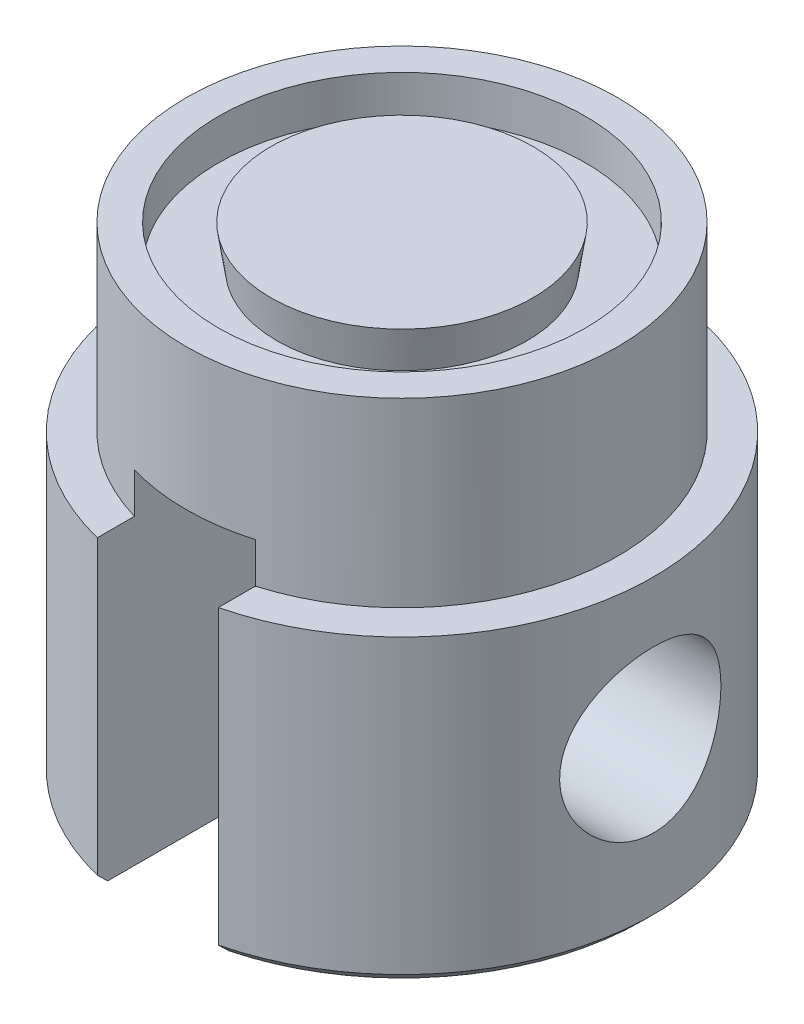
ISO-10303-21;
HEADER;
FILE_DESCRIPTION(('STEP AP214'),'2;1');
FILE_NAME('part.step','',(''),(''),'','','');
FILE_SCHEMA(('AUTOMOTIVE_DESIGN { 1 0 10303 214 1 1 1 1 }'));
ENDSEC;
DATA;
#1=APPLICATION_CONTEXT('core data for automotive mechanical design processes');
#2=APPLICATION_PROTOCOL_DEFINITION('international standard','automotive_design',2000,#1);
#3=PRODUCT_CONTEXT('',#1,'mechanical');
#4=PRODUCT('Part','Part','',(#3));
#5=PRODUCT_RELATED_PRODUCT_CATEGORY('part','',(#4));
#6=PRODUCT_DEFINITION_FORMATION('','',#4);
#7=PRODUCT_DEFINITION_CONTEXT('part definition',#1,'design');
#8=PRODUCT_DEFINITION('design','',#6,#7);
#9=PRODUCT_DEFINITION_SHAPE('','',#8);
#10=(LENGTH_UNIT() NAMED_UNIT(*) SI_UNIT(.MILLI.,.METRE.));
#11=(NAMED_UNIT(*) PLANE_ANGLE_UNIT() SI_UNIT($,.RADIAN.));
#12=(NAMED_UNIT(*) SI_UNIT($,.STERADIAN.) SOLID_ANGLE_UNIT());
#13=UNCERTAINTY_MEASURE_WITH_UNIT(LENGTH_MEASURE(1.E-05),#10,'distance_accuracy_value','');
#14=(GEOMETRIC_REPRESENTATION_CONTEXT(3) GLOBAL_UNCERTAINTY_ASSIGNED_CONTEXT((#13)) GLOBAL_UNIT_ASSIGNED_CONTEXT((#10,
#11,#12)) REPRESENTATION_CONTEXT('',''));
#15=CARTESIAN_POINT('',(0.,0.,0.));
#16=DIRECTION('',(0.,0.,1.));
#17=DIRECTION('',(1.,0.,0.));
#18=AXIS2_PLACEMENT_3D('',#15,#16,#17);
#19=CARTESIAN_POINT('',(-12.475,-9.,0.));
#20=DIRECTION('',(0.,1.,0.));
#21=DIRECTION('',(0.,0.,1.));
#22=AXIS2_PLACEMENT_3D('',#19,#20,#21);
#23=PLANE('',#22);
#24=DIRECTION('',(0.,0.,1.));
#25=VECTOR('',#24,1.);
#26=CARTESIAN_POINT('',(-3.,-9.,0.));
#27=LINE('',#26,#25);
#28=CARTESIAN_POINT('',(-3.,-9.,-12.1089068457892));
#29=VERTEX_POINT('',#28);
#30=CARTESIAN_POINT('',(-3.,-9.,-10.2708324881676));
#31=VERTEX_POINT('',#30);
#32=EDGE_CURVE('E138',#29,#31,#27,.T.);
#33=ORIENTED_EDGE('',*,*,#32,.F.);
#34=CARTESIAN_POINT('',(0.,-9.,0.));
#35=DIRECTION('',(0.,1.,0.));
#36=DIRECTION('',(0.,0.,1.));
#37=AXIS2_PLACEMENT_3D('',#34,#35,#36);
#38=CIRCLE('',#37,12.475);
#39=CARTESIAN_POINT('',(-3.,-9.,12.1089068457892));
#40=VERTEX_POINT('',#39);
#41=EDGE_CURVE('E169',#29,#40,#38,.T.);
#42=ORIENTED_EDGE('',*,*,#41,.T.);
#43=CARTESIAN_POINT('',(-3.,-9.,10.2708324881676));
#44=VERTEX_POINT('',#43);
#45=EDGE_CURVE('E148',#44,#40,#27,.T.);
#46=ORIENTED_EDGE('',*,*,#45,.F.);
#47=CARTESIAN_POINT('',(0.,-9.,0.));
#48=DIRECTION('',(0.,1.,0.));
#49=DIRECTION('',(0.,0.,1.));
#50=AXIS2_PLACEMENT_3D('',#47,#48,#49);
#51=CIRCLE('',#50,10.7);
#52=EDGE_CURVE('E175',#31,#44,#51,.T.);
#53=ORIENTED_EDGE('',*,*,#52,.F.);
#54=EDGE_LOOP('',(#33,#42,#46,#53));
#55=FACE_BOUND('',#54,.T.);
#56=ADVANCED_FACE('F32',(#55),#23,.T.);
#57=CARTESIAN_POINT('',(0.,0.,0.));
#58=DIRECTION('',(0.,1.,0.));
#59=DIRECTION('',(0.,0.,1.));
#60=AXIS2_PLACEMENT_3D('',#57,#58,#59);
#61=CYLINDRICAL_SURFACE('',#60,12.475);
#62=CARTESIAN_POINT('',(-12.475,-12.,0.));
#63=CARTESIAN_POINT('',(-12.4749995139987,-12.0000005360059,-0.218716529110247));
#64=CARTESIAN_POINT('',(-12.4691942485326,-12.0179976823893,-0.437439975480717));
#65=CARTESIAN_POINT('',(-12.4466058032758,-12.0893099880015,-0.868472654449911));
#66=CARTESIAN_POINT('',(-12.4298206606789,-12.1426314619684,-1.08078073311153));
#67=CARTESIAN_POINT('',(-12.387102365798,-12.2825966867381,-1.49270551610944));
#68=CARTESIAN_POINT('',(-12.3611838174692,-12.3691872614064,-1.69234188413075));
#69=CARTESIAN_POINT('',(-12.3028630176797,-12.5730010186972,-2.07426052854814));
#70=CARTESIAN_POINT('',(-12.2704596427904,-12.6902295100976,-2.25653978992013));
#71=CARTESIAN_POINT('',(-12.2014256062733,-12.955977968345,-2.60446423109299));
#72=CARTESIAN_POINT('',(-12.1646992743743,-13.1053102476501,-2.76946988845796));
#73=CARTESIAN_POINT('',(-12.0917019240696,-13.429298724749,-3.07257606487168));
#74=CARTESIAN_POINT('',(-12.0554309975307,-13.6039599456027,-3.21067123445773));
#75=CARTESIAN_POINT('',(-11.9864147056354,-13.9792692831997,-3.45957380721923));
#76=CARTESIAN_POINT('',(-11.9537868569233,-14.1804791344763,-3.56956989199369));
#77=CARTESIAN_POINT('',(-11.8971959388877,-14.5997568517174,-3.75389375003612));
#78=CARTESIAN_POINT('',(-11.8732304499738,-14.8178199894935,-3.82823148537808));
#79=CARTESIAN_POINT('',(-11.8376809760826,-15.2573755385477,-3.93676565428442));
#80=CARTESIAN_POINT('',(-11.8257306485731,-15.4785433888699,-3.97215311941641));
#81=CARTESIAN_POINT('',(-11.8144784036424,-15.9239751756848,-4.00550417775951));
#82=CARTESIAN_POINT('',(-11.8151729179765,-16.1482382208961,-4.00347832862167));
#83=CARTESIAN_POINT('',(-11.828809406831,-16.5835268152945,-3.9629891910265));
#84=CARTESIAN_POINT('',(-11.8412373453728,-16.7947134558122,-3.92605514103782));
#85=CARTESIAN_POINT('',(-11.8761029796758,-17.2077180920951,-3.81928332146221));
#86=CARTESIAN_POINT('',(-11.8985417905715,-17.4095350413824,-3.74944188619597));
#87=CARTESIAN_POINT('',(-11.9512841093102,-17.8016494474232,-3.57778849035795));
#88=CARTESIAN_POINT('',(-11.981701953461,-17.991725236198,-3.47550680880753));
#89=CARTESIAN_POINT('',(-12.0469243552602,-18.352510290474,-3.24220245127108));
#90=CARTESIAN_POINT('',(-12.0817301012408,-18.5232142858167,-3.11117198239018));
#91=CARTESIAN_POINT('',(-12.1538534939489,-18.8490358226826,-2.81664665851643));
#92=CARTESIAN_POINT('',(-12.1912114597255,-19.0030096152706,-2.65189397976041));
#93=CARTESIAN_POINT('',(-12.262758937203,-19.2814289578531,-2.29844255636494));
#94=CARTESIAN_POINT('',(-12.296948188608,-19.4058720833422,-2.10974184751244));
#95=CARTESIAN_POINT('',(-12.358698304347,-19.6225278320352,-1.71146189044504));
#96=CARTESIAN_POINT('',(-12.3861997853495,-19.7144547808581,-1.50171740834568));
#97=CARTESIAN_POINT('',(-12.4310462265841,-19.8613751787336,-1.06865230222356));
#98=CARTESIAN_POINT('',(-12.4483944403095,-19.916380459725,-0.845336052458977));
#99=CARTESIAN_POINT('',(-12.4704501985938,-19.985917960839,-0.401165060374678));
#100=CARTESIAN_POINT('',(-12.4756407047232,-20.0019974180946,-0.180576184698425));
#101=CARTESIAN_POINT('',(-12.4742323099182,-19.9976065373865,0.260178700328372));
#102=CARTESIAN_POINT('',(-12.4676352326971,-19.9771418533412,0.480344769817667));
#103=CARTESIAN_POINT('',(-12.4437109136667,-19.9014791805184,0.907950254804144));
#104=CARTESIAN_POINT('',(-12.4266717213786,-19.8472129806761,1.115572224401));
#105=CARTESIAN_POINT('',(-12.3838729162273,-19.7066353898048,1.51869708609424));
#106=CARTESIAN_POINT('',(-12.3581122107684,-19.6203199836502,1.71419845613877));
#107=CARTESIAN_POINT('',(-12.2997001304643,-19.4156741992699,2.0930071853402));
#108=CARTESIAN_POINT('',(-12.2668917149897,-19.2965930701891,2.27588407018708));
#109=CARTESIAN_POINT('',(-12.1981242103405,-19.030689459409,2.61957257914628));
#110=CARTESIAN_POINT('',(-12.162164225962,-18.883859081743,2.78037790032296));
#111=CARTESIAN_POINT('',(-12.0892469443718,-18.5593460331726,3.08235179747594));
#112=CARTESIAN_POINT('',(-12.0523108969037,-18.3806292990131,3.22241683631407));
#113=CARTESIAN_POINT('',(-11.9831822045273,-18.0014282798997,3.47068195088737));
#114=CARTESIAN_POINT('',(-11.9509895238994,-17.8009441588838,3.5788822665843));
#115=CARTESIAN_POINT('',(-11.8953360615663,-17.3841374550545,3.75973175782995));
#116=CARTESIAN_POINT('',(-11.8718470977001,-17.1678687536019,3.83249591857605));
#117=CARTESIAN_POINT('',(-11.8365129105098,-16.7252330313213,3.94028773137452));
#118=CARTESIAN_POINT('',(-11.8246629505738,-16.4988701576601,3.97533073499576));
#119=CARTESIAN_POINT('',(-11.8144596013936,-16.0540576344009,4.00554560484048));
#120=CARTESIAN_POINT('',(-11.8154906680489,-15.8357441513263,4.00253580967695));
#121=CARTESIAN_POINT('',(-11.829427631134,-15.4029008891127,3.96115294780775));
#122=CARTESIAN_POINT('',(-11.8423329174407,-15.1883709161459,3.92278169805022));
#123=CARTESIAN_POINT('',(-11.8781230093645,-14.7726248338063,3.81301000219897));
#124=CARTESIAN_POINT('',(-11.9008423382915,-14.5712490834383,3.74215608894064));
#125=CARTESIAN_POINT('',(-11.9536508889283,-14.1830850183708,3.56986503296479));
#126=CARTESIAN_POINT('',(-11.9837416646728,-13.996299790583,3.46842144034568));
#127=CARTESIAN_POINT('',(-12.0494371631587,-13.6343479886769,3.23298407958125));
#128=CARTESIAN_POINT('',(-12.0852170259248,-13.4599686838105,3.09782905670221));
#129=CARTESIAN_POINT('',(-12.1574822001888,-13.1357768998528,2.80081775537237));
#130=CARTESIAN_POINT('',(-12.1939677019925,-12.9859711543439,2.63895418260612));
#131=CARTESIAN_POINT('',(-12.2650668280077,-12.7099116467927,2.28630363160152));
#132=CARTESIAN_POINT('',(-12.2995701164844,-12.5846666796025,2.09470211930446));
#133=CARTESIAN_POINT('',(-12.3613891314269,-12.3683189897842,1.69206286568374));
#134=CARTESIAN_POINT('',(-12.3887073110661,-12.2772046096119,1.48103179140166));
#135=CARTESIAN_POINT('',(-12.4315017960826,-12.1372629176453,1.06061110318652));
#136=CARTESIAN_POINT('',(-12.4476672514307,-12.0859437800199,0.852120194497765));
#137=CARTESIAN_POINT('',(-12.4694153811539,-12.0173159489015,0.429087478703662));
#138=CARTESIAN_POINT('',(-12.4750004767365,-11.9999994742122,0.214547067372944));
#139=CARTESIAN_POINT('',(-12.475,-12.,0.));
#140=B_SPLINE_CURVE_WITH_KNOTS('',3,(#62,#63,#64,#65,#66,#67,#68,#69,#70,#71,#72,#73,#74,#75,
#76,#77,#78,#79,#80,#81,#82,#83,#84,#85,#86,#87,#88,#89,#90,#91,#92,#93,#94,#95,#96,#97,#98,#99,
#100,#101,#102,#103,#104,#105,#106,#107,#108,#109,#110,#111,#112,#113,#114,#115,#116,#117,#118,
#119,#120,#121,#122,#123,#124,#125,#126,#127,#128,#129,#130,#131,#132,#133,#134,#135,#136,#137,
#138,#139),.UNSPECIFIED.,.T.,.F.,(4,2,2,2,2,2,2,2,2,2,2,2,2,2,2,2,2,2,2,2,2,2,2,2,2,2,2,2,2,2,2,
2,2,2,2,2,2,2,4),(0.,0.655360630044577,1.3108384469701,1.96527290118171,2.61982082764279,
3.29344287525122,3.96719869406012,4.65863783939568,5.34988370081177,6.01934864674915,
6.68862467947721,7.32987718545076,7.97120113988384,8.62227118061441,9.27351792454189,
9.95607128249465,10.6386806595733,11.3271463407797,12.0153912904177,12.6757947907185,
13.3360961256959,13.9789550586526,14.6218945561876,15.2810079490902,15.9403091739137,
16.6272041728203,17.3140939988358,17.9987398646902,18.6831069913074,19.3349006495619,
19.9866608191133,20.6278360470582,21.2691465628643,21.936677382078,22.6043908118829,
23.2954931077488,23.9863591370202,24.6293735870827,25.2722408720554),.UNSPECIFIED.);
#141=CARTESIAN_POINT('',(-12.475,-12.,0.));
#142=VERTEX_POINT('',#141);
#143=EDGE_CURVE('E128',#142,#142,#140,.T.);
#144=ORIENTED_EDGE('',*,*,#143,.F.);
#145=EDGE_LOOP('',(#144));
#146=FACE_BOUND('',#145,.T.);
#147=DIRECTION('',(0.,1.,0.));
#148=VECTOR('',#147,1.);
#149=CARTESIAN_POINT('',(-3.,0.,-12.1089068457892));
#150=LINE('',#149,#148);
#151=CARTESIAN_POINT('',(-3.,-23.5,-12.1089068457892));
#152=VERTEX_POINT('',#151);
#153=EDGE_CURVE('E135',#152,#29,#150,.T.);
#154=ORIENTED_EDGE('',*,*,#153,.F.);
#155=CARTESIAN_POINT('',(0.,-23.5,0.));
#156=DIRECTION('',(0.,-1.,0.));
#157=DIRECTION('',(0.,0.,-1.));
#158=AXIS2_PLACEMENT_3D('',#155,#156,#157);
#159=CIRCLE('',#158,12.475);
#160=CARTESIAN_POINT('',(-3.,-23.5,12.1089068457892));
#161=VERTEX_POINT('',#160);
#162=EDGE_CURVE('E229',#152,#161,#159,.F.);
#163=ORIENTED_EDGE('',*,*,#162,.T.);
#164=DIRECTION('',(0.,1.,0.));
#165=VECTOR('',#164,1.);
#166=CARTESIAN_POINT('',(-3.,0.,12.1089068457892));
#167=LINE('',#166,#165);
#168=EDGE_CURVE('E150',#40,#161,#167,.F.);
#169=ORIENTED_EDGE('',*,*,#168,.F.);
#170=ORIENTED_EDGE('',*,*,#41,.F.);
#171=EDGE_LOOP('',(#154,#163,#169,#170));
#172=FACE_BOUND('',#171,.T.);
#173=ADVANCED_FACE('F281',(#146,#172),#61,.T.);
#174=CARTESIAN_POINT('',(-12.475,-24.,0.));
#175=DIRECTION('',(0.,-1.,0.));
#176=DIRECTION('',(0.,0.,-1.));
#177=AXIS2_PLACEMENT_3D('',#174,#175,#176);
#178=PLANE('',#177);
#179=DIRECTION('',(0.,0.,-1.));
#180=VECTOR('',#179,1.);
#181=CARTESIAN_POINT('',(-3.,-24.,0.));
#182=LINE('',#181,#180);
#183=CARTESIAN_POINT('',(-3.,-24.,11.5931283526061));
#184=VERTEX_POINT('',#183);
#185=CARTESIAN_POINT('',(-3.,-24.,-11.5931283526061));
#186=VERTEX_POINT('',#185);
#187=EDGE_CURVE('E178',#184,#186,#182,.T.);
#188=ORIENTED_EDGE('',*,*,#187,.F.);
#189=CARTESIAN_POINT('',(0.,-24.,0.));
#190=DIRECTION('',(0.,-1.,0.));
#191=DIRECTION('',(0.,0.,-1.));
#192=AXIS2_PLACEMENT_3D('',#189,#190,#191);
#193=CIRCLE('',#192,11.975);
#194=EDGE_CURVE('E11',#184,#186,#193,.T.);
#195=ORIENTED_EDGE('',*,*,#194,.T.);
#196=EDGE_LOOP('',(#188,#195));
#197=FACE_BOUND('',#196,.T.);
#198=ADVANCED_FACE('F287',(#197),#178,.T.);
#199=CARTESIAN_POINT('',(0.,0.,0.));
#200=DIRECTION('',(0.,1.,0.));
#201=DIRECTION('',(0.,0.,1.));
#202=AXIS2_PLACEMENT_3D('',#199,#200,#201);
#203=CYLINDRICAL_SURFACE('',#202,10.7);
#204=DIRECTION('',(0.,1.,0.));
#205=VECTOR('',#204,1.);
#206=CARTESIAN_POINT('',(-3.,0.,-10.2708324881676));
#207=LINE('',#206,#205);
#208=CARTESIAN_POINT('',(-3.,-7.,-10.2708324881676));
#209=VERTEX_POINT('',#208);
#210=EDGE_CURVE('E147',#31,#209,#207,.T.);
#211=ORIENTED_EDGE('',*,*,#210,.F.);
#212=ORIENTED_EDGE('',*,*,#52,.T.);
#213=DIRECTION('',(0.,1.,0.));
#214=VECTOR('',#213,1.);
#215=CARTESIAN_POINT('',(-3.,0.,10.2708324881676));
#216=LINE('',#215,#214);
#217=CARTESIAN_POINT('',(-3.,-7.,10.2708324881676));
#218=VERTEX_POINT('',#217);
#219=EDGE_CURVE('E152',#218,#44,#216,.F.);
#220=ORIENTED_EDGE('',*,*,#219,.F.);
#221=CARTESIAN_POINT('',(0.,-7.,0.));
#222=DIRECTION('',(0.,1.,0.));
#223=DIRECTION('',(0.,0.,1.));
#224=AXIS2_PLACEMENT_3D('',#221,#222,#223);
#225=CIRCLE('',#224,10.7);
#226=CARTESIAN_POINT('',(3.,-7.,10.2708324881676));
#227=VERTEX_POINT('',#226);
#228=EDGE_CURVE('E119',#227,#218,#225,.F.);
#229=ORIENTED_EDGE('',*,*,#228,.F.);
#230=DIRECTION('',(0.,1.,0.));
#231=VECTOR('',#230,1.);
#232=CARTESIAN_POINT('',(3.,0.,10.2708324881676));
#233=LINE('',#232,#231);
#234=CARTESIAN_POINT('',(3.,-9.,10.2708324881676));
#235=VERTEX_POINT('',#234);
#236=EDGE_CURVE('E127',#235,#227,#233,.T.);
#237=ORIENTED_EDGE('',*,*,#236,.F.);
#238=CARTESIAN_POINT('',(3.,-9.,-10.2708324881676));
#239=VERTEX_POINT('',#238);
#240=EDGE_CURVE('E134',#235,#239,#51,.T.);
#241=ORIENTED_EDGE('',*,*,#240,.T.);
#242=DIRECTION('',(0.,1.,0.));
#243=VECTOR('',#242,1.);
#244=CARTESIAN_POINT('',(3.,0.,-10.2708324881676));
#245=LINE('',#244,#243);
#246=CARTESIAN_POINT('',(3.,-7.,-10.2708324881676));
#247=VERTEX_POINT('',#246);
#248=EDGE_CURVE('E124',#247,#239,#245,.F.);
#249=ORIENTED_EDGE('',*,*,#248,.F.);
#250=EDGE_CURVE('E108',#209,#247,#225,.F.);
#251=ORIENTED_EDGE('',*,*,#250,.F.);
#252=EDGE_LOOP('',(#211,#212,#220,#229,#237,#241,#249,#251));
#253=FACE_BOUND('',#252,.T.);
#254=CARTESIAN_POINT('',(0.,0.,0.));
#255=DIRECTION('',(0.,1.,0.));
#256=DIRECTION('',(0.,0.,1.));
#257=AXIS2_PLACEMENT_3D('',#254,#255,#256);
#258=CIRCLE('',#257,10.7);
#259=CARTESIAN_POINT('',(0.,0.,10.7));
#260=VERTEX_POINT('',#259);
#261=EDGE_CURVE('E154',#260,#260,#258,.T.);
#262=ORIENTED_EDGE('',*,*,#261,.F.);
#263=EDGE_LOOP('',(#262));
#264=FACE_BOUND('',#263,.T.);
#265=ADVANCED_FACE('F131',(#253,#264),#203,.T.);
#266=DIRECTION('',(0.,0.,-1.));
#267=VECTOR('',#266,1.);
#268=CARTESIAN_POINT('',(3.,-9.,0.));
#269=LINE('',#268,#267);
#270=CARTESIAN_POINT('',(3.,-9.,12.1089068457892));
#271=VERTEX_POINT('',#270);
#272=EDGE_CURVE('E142',#271,#235,#269,.T.);
#273=ORIENTED_EDGE('',*,*,#272,.F.);
#274=CARTESIAN_POINT('',(3.,-9.,-12.1089068457892));
#275=VERTEX_POINT('',#274);
#276=EDGE_CURVE('E172',#271,#275,#38,.T.);
#277=ORIENTED_EDGE('',*,*,#276,.T.);
#278=EDGE_CURVE('E136',#239,#275,#269,.T.);
#279=ORIENTED_EDGE('',*,*,#278,.F.);
#280=ORIENTED_EDGE('',*,*,#240,.F.);
#281=EDGE_LOOP('',(#273,#277,#279,#280));
#282=FACE_BOUND('',#281,.T.);
#283=ADVANCED_FACE('F283',(#282),#23,.T.);
#284=CARTESIAN_POINT('',(11.8163287445805,-16.,-4.));
#285=CARTESIAN_POINT('',(11.8163293716046,-15.781609970276,-3.9999994343158));
#286=CARTESIAN_POINT('',(11.8224494097261,-15.563213018424,-3.98205403855416));
#287=CARTESIAN_POINT('',(11.8461529080135,-15.1328561161005,-3.91096593534317));
#288=CARTESIAN_POINT('',(11.8637389903266,-14.9208976496407,-3.85781517680383));
#289=CARTESIAN_POINT('',(11.9081823519474,-14.5097163925374,-3.71834848933976));
#290=CARTESIAN_POINT('',(11.9350225456114,-14.3104709279899,-3.63209364671756));
#291=CARTESIAN_POINT('',(11.9949257570381,-13.9292198049383,-3.42907298676926));
#292=CARTESIAN_POINT('',(12.0279899818919,-13.7472175008901,-3.31230124927523));
#293=CARTESIAN_POINT('',(12.0979573717117,-13.3990345911543,-3.04703684141803));
#294=CARTESIAN_POINT('',(12.134950916007,-13.2335693065452,-2.89762886344134));
#295=CARTESIAN_POINT('',(12.2078416485258,-12.929560825762,-2.57328972032871));
#296=CARTESIAN_POINT('',(12.2437386744481,-12.7910215989288,-2.39835479874891));
#297=CARTESIAN_POINT('',(12.3114304068411,-12.5416072219937,-2.02275240917753));
#298=CARTESIAN_POINT('',(12.343106345104,-12.4314736630668,-1.82156920734679));
#299=CARTESIAN_POINT('',(12.3977278393928,-12.24688880762,-1.40234516910522));
#300=CARTESIAN_POINT('',(12.4206755618851,-12.1724286552636,-1.1843085321436));
#301=CARTESIAN_POINT('',(12.4546151476856,-12.0637069622264,-0.745060624805799));
#302=CARTESIAN_POINT('',(12.4659701166171,-12.0282217418228,-0.524180810154712));
#303=CARTESIAN_POINT('',(12.4767297133512,-11.9945748134697,-0.0793299306597381));
#304=CARTESIAN_POINT('',(12.4761371968552,-11.9964041865455,0.144640382700019));
#305=CARTESIAN_POINT('',(12.4633188207247,-12.0365405781829,0.580683422524086));
#306=CARTESIAN_POINT('',(12.451516335416,-12.0735200969508,0.792892794508262));
#307=CARTESIAN_POINT('',(12.4181290258081,-12.1807223296242,1.2079169454142));
#308=CARTESIAN_POINT('',(12.3965435529035,-12.2509472476909,1.41073110045658));
#309=CARTESIAN_POINT('',(12.3454585586366,-12.4234695738055,1.80420881218555));
#310=CARTESIAN_POINT('',(12.31586270281,-12.5261601287241,1.99468696864473));
#311=CARTESIAN_POINT('',(12.2518608711338,-12.7603801381026,2.35611277682023));
#312=CARTESIAN_POINT('',(12.2174536316828,-12.891917173614,2.52705527643544));
#313=CARTESIAN_POINT('',(12.1457008814245,-13.1868640170738,2.85246658813641));
#314=CARTESIAN_POINT('',(12.1082926795379,-13.3514166808028,3.00588718523103));
#315=CARTESIAN_POINT('',(12.036042035235,-13.7042533539727,3.2832781963095));
#316=CARTESIAN_POINT('',(12.0011999296185,-13.8925404697934,3.40724474919171));
#317=CARTESIAN_POINT('',(11.9376996145303,-14.290600184222,3.62351565554029));
#318=CARTESIAN_POINT('',(11.9091228620333,-14.5006088645345,3.71541119879147));
#319=CARTESIAN_POINT('',(11.862338877103,-14.9342608650721,3.86219440784835));
#320=CARTESIAN_POINT('',(11.8441276843777,-15.157898941813,3.91709620905183));
#321=CARTESIAN_POINT('',(11.8210223950061,-15.6023754944969,3.98626848007884));
#322=CARTESIAN_POINT('',(11.815600040764,-15.8229356109446,4.00215187071912));
#323=CARTESIAN_POINT('',(11.8172158509013,-16.2635917112,3.99738017985765));
#324=CARTESIAN_POINT('',(11.8242519636016,-16.483687765454,3.9767311145762));
#325=CARTESIAN_POINT('',(11.84946838581,-16.9100750512054,3.90092524500849));
#326=CARTESIAN_POINT('',(11.8672969562793,-17.1165827127413,3.84685650154382));
#327=CARTESIAN_POINT('',(11.911711298621,-17.5175648815649,3.70703431432635));
#328=CARTESIAN_POINT('',(11.9382985476178,-17.7120373525784,3.62127552584684));
#329=CARTESIAN_POINT('',(11.9982195654303,-18.0898611783651,3.41758857334324));
#330=CARTESIAN_POINT('',(12.0317311413693,-18.2727067889399,3.29877597219038));
#331=CARTESIAN_POINT('',(12.1013657583466,-18.6164512162654,3.03337484828727));
#332=CARTESIAN_POINT('',(12.1374895115127,-18.7773440134982,2.88677873344595));
#333=CARTESIAN_POINT('',(12.2102002232495,-19.0799197200499,2.56230844872162));
#334=CARTESIAN_POINT('',(12.2467376956915,-19.2204467467187,2.38334231775368));
#335=CARTESIAN_POINT('',(12.3145795104043,-19.4695310477567,2.00347852549681));
#336=CARTESIAN_POINT('',(12.3458840745258,-19.5780896775848,1.80258179455969));
#337=CARTESIAN_POINT('',(12.3995650863031,-19.7591273785531,1.38571693466352));
#338=CARTESIAN_POINT('',(12.4220038795769,-19.8318593164123,1.16986706924294));
#339=CARTESIAN_POINT('',(12.4556978393589,-19.9397262864152,0.728146957074522));
#340=CARTESIAN_POINT('',(12.4669567097841,-19.9748737706136,0.502280054902824));
#341=CARTESIAN_POINT('',(12.4767636438736,-20.0055201390873,0.0575508098984067));
#342=CARTESIAN_POINT('',(12.4758456625697,-20.0026845268186,-0.161186303224309));
#343=CARTESIAN_POINT('',(12.4626947180971,-19.9615038384338,-0.594924590643198));
#344=CARTESIAN_POINT('',(12.4504625600074,-19.9231612888718,-0.809926029648436));
#345=CARTESIAN_POINT('',(12.4162372396316,-19.813133707566,-1.22716701468585));
#346=CARTESIAN_POINT('',(12.3943807111078,-19.7419147496507,-1.42954146080464));
#347=CARTESIAN_POINT('',(12.343158433364,-19.568580644655,-1.8195595067818));
#348=CARTESIAN_POINT('',(12.3137913658037,-19.4664600727741,-2.0072005128838));
#349=CARTESIAN_POINT('',(12.2493136501122,-19.2300794543179,-2.36960360299367));
#350=CARTESIAN_POINT('',(12.2140374656039,-19.0948163306878,-2.54368163147346));
#351=CARTESIAN_POINT('',(12.1421662663895,-18.7977349176947,-2.86721845988402));
#352=CARTESIAN_POINT('',(12.1055708497214,-18.6359084803597,-3.0166696775669));
#353=CARTESIAN_POINT('',(12.0336580860965,-18.2834315094479,-3.29206661731546));
#354=CARTESIAN_POINT('',(11.9984318905324,-18.0919631827171,-3.41699253733949));
#355=CARTESIAN_POINT('',(11.9348771507562,-17.6896742497424,-3.63277471822105));
#356=CARTESIAN_POINT('',(11.9065461859488,-17.4788604706806,-3.72364294122072));
#357=CARTESIAN_POINT('',(11.8619819984379,-17.0589857693917,-3.863160909192));
#358=CARTESIAN_POINT('',(11.8450414210958,-16.8508328644325,-3.91431827899697));
#359=CARTESIAN_POINT('',(11.8222160417219,-16.4284543762484,-3.98273333352506));
#360=CARTESIAN_POINT('',(11.8163281294989,-16.2142305186031,-4.00000055491004));
#361=CARTESIAN_POINT('',(11.8163287445805,-16.,-4.));
#362=B_SPLINE_CURVE_WITH_KNOTS('',3,(#284,#285,#286,#287,#288,#289,#290,#291,#292,#293,#294,
#295,#296,#297,#298,#299,#300,#301,#302,#303,#304,#305,#306,#307,#308,#309,#310,#311,#312,#313,
#314,#315,#316,#317,#318,#319,#320,#321,#322,#323,#324,#325,#326,#327,#328,#329,#330,#331,#332,
#333,#334,#335,#336,#337,#338,#339,#340,#341,#342,#343,#344,#345,#346,#347,#348,#349,#350,#351,
#352,#353,#354,#355,#356,#357,#358,#359,#360,#361),.UNSPECIFIED.,.T.,.F.,(4,2,2,2,2,2,2,2,2,2,2,
2,2,2,2,2,2,2,2,2,2,2,2,2,2,2,2,2,2,2,2,2,2,2,2,2,2,2,4),(0.,0.654377980738784,1.30890566241563,
1.96223131962546,2.61568381387018,3.29058282417283,3.965581250282,4.65673742799333,
5.34772193884292,6.01633007625846,6.68477840410295,7.32894469912126,7.97315370817976,
8.62548362856243,9.27798519157205,9.95903985359692,10.6401837452094,11.3297176810265,
12.0189879946339,12.6792467224649,13.3393967280072,13.9791101745699,14.6189315621352,
15.2778656759669,15.9369801096708,16.6250789669798,17.3131486447209,17.9962897027185,
18.6792043599821,19.3322760119477,19.9853011971012,20.6293403458794,21.2734926218483,
21.9402751550424,22.6072625991433,23.2978696402868,23.9882338905434,24.6303291356463,
25.2722436697177),.UNSPECIFIED.);
#363=CARTESIAN_POINT('',(11.8163287445805,-16.,-4.));
#364=VERTEX_POINT('',#363);
#365=EDGE_CURVE('E261',#364,#364,#362,.T.);
#366=ORIENTED_EDGE('',*,*,#365,.F.);
#367=EDGE_LOOP('',(#366));
#368=FACE_BOUND('',#367,.T.);
#369=DIRECTION('',(0.,1.,0.));
#370=VECTOR('',#369,1.);
#371=CARTESIAN_POINT('',(3.,0.,12.1089068457892));
#372=LINE('',#371,#370);
#373=CARTESIAN_POINT('',(3.,-23.5,12.1089068457892));
#374=VERTEX_POINT('',#373);
#375=EDGE_CURVE('E246',#374,#271,#372,.T.);
#376=ORIENTED_EDGE('',*,*,#375,.F.);
#377=CARTESIAN_POINT('',(0.,-23.5,0.));
#378=DIRECTION('',(0.,-1.,0.));
#379=DIRECTION('',(0.,0.,-1.));
#380=AXIS2_PLACEMENT_3D('',#377,#378,#379);
#381=CIRCLE('',#380,12.475);
#382=CARTESIAN_POINT('',(3.,-23.5,-12.1089068457892));
#383=VERTEX_POINT('',#382);
#384=EDGE_CURVE('E118',#374,#383,#381,.F.);
#385=ORIENTED_EDGE('',*,*,#384,.T.);
#386=DIRECTION('',(0.,1.,0.));
#387=VECTOR('',#386,1.);
#388=CARTESIAN_POINT('',(3.,0.,-12.1089068457892));
#389=LINE('',#388,#387);
#390=EDGE_CURVE('E140',#275,#383,#389,.F.);
#391=ORIENTED_EDGE('',*,*,#390,.F.);
#392=ORIENTED_EDGE('',*,*,#276,.F.);
#393=EDGE_LOOP('',(#376,#385,#391,#392));
#394=FACE_BOUND('',#393,.T.);
#395=ADVANCED_FACE('F250',(#368,#394),#61,.T.);
#396=DIRECTION('',(0.,0.,1.));
#397=VECTOR('',#396,1.);
#398=CARTESIAN_POINT('',(3.,-24.,0.));
#399=LINE('',#398,#397);
#400=CARTESIAN_POINT('',(3.,-24.,-11.5931283526061));
#401=VERTEX_POINT('',#400);
#402=CARTESIAN_POINT('',(3.,-24.,11.5931283526061));
#403=VERTEX_POINT('',#402);
#404=EDGE_CURVE('E174',#401,#403,#399,.T.);
#405=ORIENTED_EDGE('',*,*,#404,.F.);
#406=CARTESIAN_POINT('',(0.,-24.,0.));
#407=DIRECTION('',(0.,-1.,0.));
#408=DIRECTION('',(0.,0.,-1.));
#409=AXIS2_PLACEMENT_3D('',#406,#407,#408);
#410=CIRCLE('',#409,11.975);
#411=EDGE_CURVE('E233',#401,#403,#410,.T.);
#412=ORIENTED_EDGE('',*,*,#411,.T.);
#413=EDGE_LOOP('',(#405,#412));
#414=FACE_BOUND('',#413,.T.);
#415=ADVANCED_FACE('F244',(#414),#178,.T.);
#416=CARTESIAN_POINT('',(-6.5,0.,0.));
#417=DIRECTION('',(0.,1.,0.));
#418=DIRECTION('',(0.,0.,1.));
#419=AXIS2_PLACEMENT_3D('',#416,#417,#418);
#420=PLANE('',#419);
#421=CARTESIAN_POINT('',(0.,0.,0.));
#422=DIRECTION('',(0.,1.,0.));
#423=DIRECTION('',(0.,0.,1.));
#424=AXIS2_PLACEMENT_3D('',#421,#422,#423);
#425=CIRCLE('',#424,6.5);
#426=CARTESIAN_POINT('',(0.,0.,6.5));
#427=VERTEX_POINT('',#426);
#428=EDGE_CURVE('E166',#427,#427,#425,.T.);
#429=ORIENTED_EDGE('',*,*,#428,.T.);
#430=EDGE_LOOP('',(#429));
#431=FACE_BOUND('',#430,.T.);
#432=ADVANCED_FACE('F337',(#431),#420,.T.);
#433=CARTESIAN_POINT('',(0.,0.,0.));
#434=DIRECTION('',(0.,1.,0.));
#435=DIRECTION('',(0.,0.,1.));
#436=AXIS2_PLACEMENT_3D('',#433,#434,#435);
#437=CONICAL_SURFACE('',#436,6.5,0.148889947609497);
#438=CARTESIAN_POINT('',(0.,-2.,0.));
#439=DIRECTION('',(0.,1.,0.));
#440=DIRECTION('',(0.,0.,1.));
#441=AXIS2_PLACEMENT_3D('',#438,#439,#440);
#442=CIRCLE('',#441,6.2);
#443=CARTESIAN_POINT('',(0.,-2.,6.2));
#444=VERTEX_POINT('',#443);
#445=EDGE_CURVE('E163',#444,#444,#442,.T.);
#446=ORIENTED_EDGE('',*,*,#445,.T.);
#447=EDGE_LOOP('',(#446));
#448=FACE_BOUND('',#447,.T.);
#449=ORIENTED_EDGE('',*,*,#428,.F.);
#450=EDGE_LOOP('',(#449));
#451=FACE_BOUND('',#450,.T.);
#452=ADVANCED_FACE('F409',(#448,#451),#437,.T.);
#453=CARTESIAN_POINT('',(-9.1,-2.,0.));
#454=DIRECTION('',(0.,1.,0.));
#455=DIRECTION('',(0.,0.,1.));
#456=AXIS2_PLACEMENT_3D('',#453,#454,#455);
#457=PLANE('',#456);
#458=CARTESIAN_POINT('',(0.,-2.,0.));
#459=DIRECTION('',(0.,1.,0.));
#460=DIRECTION('',(0.,0.,1.));
#461=AXIS2_PLACEMENT_3D('',#458,#459,#460);
#462=CIRCLE('',#461,9.1);
#463=CARTESIAN_POINT('',(0.,-2.,9.1));
#464=VERTEX_POINT('',#463);
#465=EDGE_CURVE('E160',#464,#464,#462,.T.);
#466=ORIENTED_EDGE('',*,*,#465,.T.);
#467=EDGE_LOOP('',(#466));
#468=FACE_BOUND('',#467,.T.);
#469=ORIENTED_EDGE('',*,*,#445,.F.);
#470=EDGE_LOOP('',(#469));
#471=FACE_BOUND('',#470,.T.);
#472=ADVANCED_FACE('F400',(#468,#471),#457,.T.);
#473=CARTESIAN_POINT('',(0.,0.,0.));
#474=DIRECTION('',(0.,1.,0.));
#475=DIRECTION('',(0.,0.,1.));
#476=AXIS2_PLACEMENT_3D('',#473,#474,#475);
#477=CYLINDRICAL_SURFACE('',#476,9.1);
#478=CARTESIAN_POINT('',(0.,0.,0.));
#479=DIRECTION('',(0.,1.,0.));
#480=DIRECTION('',(0.,0.,1.));
#481=AXIS2_PLACEMENT_3D('',#478,#479,#480);
#482=CIRCLE('',#481,9.1);
#483=CARTESIAN_POINT('',(0.,0.,9.1));
#484=VERTEX_POINT('',#483);
#485=EDGE_CURVE('E157',#484,#484,#482,.T.);
#486=ORIENTED_EDGE('',*,*,#485,.T.);
#487=EDGE_LOOP('',(#486));
#488=FACE_BOUND('',#487,.T.);
#489=ORIENTED_EDGE('',*,*,#465,.F.);
#490=EDGE_LOOP('',(#489));
#491=FACE_BOUND('',#490,.T.);
#492=ADVANCED_FACE('F391',(#488,#491),#477,.F.);
#493=CARTESIAN_POINT('',(-10.7,0.,0.));
#494=DIRECTION('',(0.,1.,0.));
#495=DIRECTION('',(0.,0.,1.));
#496=AXIS2_PLACEMENT_3D('',#493,#494,#495);
#497=PLANE('',#496);
#498=ORIENTED_EDGE('',*,*,#261,.T.);
#499=EDGE_LOOP('',(#498));
#500=FACE_BOUND('',#499,.T.);
#501=ORIENTED_EDGE('',*,*,#485,.F.);
#502=EDGE_LOOP('',(#501));
#503=FACE_BOUND('',#502,.T.);
#504=ADVANCED_FACE('F214',(#500,#503),#497,.T.);
#505=CARTESIAN_POINT('',(-3.,-7.,-12.475));
#506=DIRECTION('',(-1.,0.,0.));
#507=DIRECTION('',(0.,-1.,0.));
#508=AXIS2_PLACEMENT_3D('',#505,#506,#507);
#509=PLANE('',#508);
#510=CARTESIAN_POINT('',(-3.,-16.,0.));
#511=DIRECTION('',(-1.,0.,0.));
#512=DIRECTION('',(0.,-1.,0.));
#513=AXIS2_PLACEMENT_3D('',#510,#511,#512);
#514=CIRCLE('',#513,4.);
#515=CARTESIAN_POINT('',(-3.,-20.,0.));
#516=VERTEX_POINT('',#515);
#517=EDGE_CURVE('E183',#516,#516,#514,.T.);
#518=ORIENTED_EDGE('',*,*,#517,.T.);
#519=EDGE_LOOP('',(#518));
#520=FACE_BOUND('',#519,.T.);
#521=ORIENTED_EDGE('',*,*,#168,.T.);
#522=CARTESIAN_POINT('',(-3.,-23.5,12.1089068457892));
#523=CARTESIAN_POINT('',(-3.,-23.58338965646,12.0229983640696));
#524=CARTESIAN_POINT('',(-3.,-23.6667511512652,11.9370625822056));
#525=CARTESIAN_POINT('',(-3.,-23.8334178179321,11.7651364178115));
#526=CARTESIAN_POINT('',(-3.,-23.9167229897935,11.6791460352811));
#527=CARTESIAN_POINT('',(-3.,-24.,11.5931283526061));
#528=B_SPLINE_CURVE_WITH_KNOTS('',3,(#522,#523,#524,#525,#526,#527),.UNSPECIFIED.,.F.,.F.,(4,2,
4),(0.,0.359175273072438,0.718350547721489),.UNSPECIFIED.);
#529=EDGE_CURVE('E41',#161,#184,#528,.T.);
#530=ORIENTED_EDGE('',*,*,#529,.T.);
#531=ORIENTED_EDGE('',*,*,#187,.T.);
#532=CARTESIAN_POINT('',(-3.,-24.,-11.5931283526061));
#533=CARTESIAN_POINT('',(-3.,-23.9167229897935,-11.6791460352811));
#534=CARTESIAN_POINT('',(-3.,-23.8334178179321,-11.7651364178115));
#535=CARTESIAN_POINT('',(-3.,-23.6667511512652,-11.9370625822056));
#536=CARTESIAN_POINT('',(-3.,-23.58338965646,-12.0229983640696));
#537=CARTESIAN_POINT('',(-3.,-23.5,-12.1089068457892));
#538=B_SPLINE_CURVE_WITH_KNOTS('',3,(#532,#533,#534,#535,#536,#537),.UNSPECIFIED.,.F.,.F.,(4,2,
4),(0.,0.359175274649051,0.718350547721489),.UNSPECIFIED.);
#539=EDGE_CURVE('E219',#186,#152,#538,.T.);
#540=ORIENTED_EDGE('',*,*,#539,.T.);
#541=ORIENTED_EDGE('',*,*,#153,.T.);
#542=ORIENTED_EDGE('',*,*,#32,.T.);
#543=ORIENTED_EDGE('',*,*,#210,.T.);
#544=DIRECTION('',(0.,0.,1.));
#545=VECTOR('',#544,1.);
#546=CARTESIAN_POINT('',(-3.,-7.,-12.475));
#547=LINE('',#546,#545);
#548=EDGE_CURVE('E114',#209,#218,#547,.T.);
#549=ORIENTED_EDGE('',*,*,#548,.T.);
#550=ORIENTED_EDGE('',*,*,#219,.T.);
#551=ORIENTED_EDGE('',*,*,#45,.T.);
#552=EDGE_LOOP('',(#521,#530,#531,#540,#541,#542,#543,#549,#550,#551));
#553=FACE_BOUND('',#552,.T.);
#554=ADVANCED_FACE('F209',(#520,#553),#509,.F.);
#555=CARTESIAN_POINT('',(-3.,-7.,-12.475));
#556=DIRECTION('',(0.,1.,0.));
#557=DIRECTION('',(0.,0.,1.));
#558=AXIS2_PLACEMENT_3D('',#555,#556,#557);
#559=PLANE('',#558);
#560=ORIENTED_EDGE('',*,*,#250,.T.);
#561=DIRECTION('',(0.,0.,1.));
#562=VECTOR('',#561,1.);
#563=CARTESIAN_POINT('',(3.,-7.,-12.475));
#564=LINE('',#563,#562);
#565=EDGE_CURVE('E111',#247,#227,#564,.T.);
#566=ORIENTED_EDGE('',*,*,#565,.T.);
#567=ORIENTED_EDGE('',*,*,#228,.T.);
#568=ORIENTED_EDGE('',*,*,#548,.F.);
#569=EDGE_LOOP('',(#560,#566,#567,#568));
#570=FACE_BOUND('',#569,.T.);
#571=ADVANCED_FACE('F110',(#570),#559,.F.);
#572=CARTESIAN_POINT('',(3.,-7.,-12.475));
#573=DIRECTION('',(1.,0.,0.));
#574=DIRECTION('',(0.,1.,0.));
#575=AXIS2_PLACEMENT_3D('',#572,#573,#574);
#576=PLANE('',#575);
#577=CARTESIAN_POINT('',(3.,-16.,0.));
#578=DIRECTION('',(1.,0.,0.));
#579=DIRECTION('',(0.,1.,0.));
#580=AXIS2_PLACEMENT_3D('',#577,#578,#579);
#581=CIRCLE('',#580,4.);
#582=CARTESIAN_POINT('',(3.,-12.,0.));
#583=VERTEX_POINT('',#582);
#584=EDGE_CURVE('E180',#583,#583,#581,.T.);
#585=ORIENTED_EDGE('',*,*,#584,.T.);
#586=EDGE_LOOP('',(#585));
#587=FACE_BOUND('',#586,.T.);
#588=ORIENTED_EDGE('',*,*,#390,.T.);
#589=CARTESIAN_POINT('',(3.,-23.5,-12.1089068457892));
#590=CARTESIAN_POINT('',(3.,-23.58338965646,-12.0229983640696));
#591=CARTESIAN_POINT('',(3.,-23.6667511512652,-11.9370625822056));
#592=CARTESIAN_POINT('',(3.,-23.8334178179321,-11.7651364178115));
#593=CARTESIAN_POINT('',(3.,-23.9167229897935,-11.6791460352811));
#594=CARTESIAN_POINT('',(3.,-24.,-11.5931283526061));
#595=B_SPLINE_CURVE_WITH_KNOTS('',3,(#589,#590,#591,#592,#593,#594),.UNSPECIFIED.,.F.,.F.,(4,2,
4),(0.,0.359175273072438,0.718350547721489),.UNSPECIFIED.);
#596=EDGE_CURVE('E193',#383,#401,#595,.T.);
#597=ORIENTED_EDGE('',*,*,#596,.T.);
#598=ORIENTED_EDGE('',*,*,#404,.T.);
#599=CARTESIAN_POINT('',(3.,-24.,11.5931283526061));
#600=CARTESIAN_POINT('',(3.,-23.9167229897935,11.6791460352811));
#601=CARTESIAN_POINT('',(3.,-23.8334178179321,11.7651364178115));
#602=CARTESIAN_POINT('',(3.,-23.6667511512652,11.9370625822056));
#603=CARTESIAN_POINT('',(3.,-23.58338965646,12.0229983640696));
#604=CARTESIAN_POINT('',(3.,-23.5,12.1089068457892));
#605=B_SPLINE_CURVE_WITH_KNOTS('',3,(#599,#600,#601,#602,#603,#604),.UNSPECIFIED.,.F.,.F.,(4,2,
4),(0.,0.359175274649051,0.718350547721489),.UNSPECIFIED.);
#606=EDGE_CURVE('E186',#403,#374,#605,.T.);
#607=ORIENTED_EDGE('',*,*,#606,.T.);
#608=ORIENTED_EDGE('',*,*,#375,.T.);
#609=ORIENTED_EDGE('',*,*,#272,.T.);
#610=ORIENTED_EDGE('',*,*,#236,.T.);
#611=ORIENTED_EDGE('',*,*,#565,.F.);
#612=ORIENTED_EDGE('',*,*,#248,.T.);
#613=ORIENTED_EDGE('',*,*,#278,.T.);
#614=EDGE_LOOP('',(#588,#597,#598,#607,#608,#609,#610,#611,#612,#613));
#615=FACE_BOUND('',#614,.T.);
#616=ADVANCED_FACE('F123',(#587,#615),#576,.F.);
#617=CARTESIAN_POINT('',(-12.475,-16.,0.));
#618=DIRECTION('',(1.,0.,0.));
#619=DIRECTION('',(0.,0.,-1.));
#620=AXIS2_PLACEMENT_3D('',#617,#618,#619);
#621=CYLINDRICAL_SURFACE('',#620,4.);
#622=ORIENTED_EDGE('',*,*,#365,.T.);
#623=EDGE_LOOP('',(#622));
#624=FACE_BOUND('',#623,.T.);
#625=ORIENTED_EDGE('',*,*,#584,.F.);
#626=EDGE_LOOP('',(#625));
#627=FACE_BOUND('',#626,.T.);
#628=ADVANCED_FACE('F206',(#624,#627),#621,.F.);
#629=ORIENTED_EDGE('',*,*,#143,.T.);
#630=EDGE_LOOP('',(#629));
#631=FACE_BOUND('',#630,.T.);
#632=ORIENTED_EDGE('',*,*,#517,.F.);
#633=EDGE_LOOP('',(#632));
#634=FACE_BOUND('',#633,.T.);
#635=ADVANCED_FACE('F269',(#631,#634),#621,.F.);
#636=CARTESIAN_POINT('',(0.,-23.5,0.));
#637=DIRECTION('',(0.,1.,0.));
#638=DIRECTION('',(0.,0.,1.));
#639=AXIS2_PLACEMENT_3D('',#636,#637,#638);
#640=CONICAL_SURFACE('',#639,12.475,0.785398163397455);
#641=ORIENTED_EDGE('',*,*,#606,.F.);
#642=ORIENTED_EDGE('',*,*,#411,.F.);
#643=ORIENTED_EDGE('',*,*,#596,.F.);
#644=ORIENTED_EDGE('',*,*,#384,.F.);
#645=EDGE_LOOP('',(#641,#642,#643,#644));
#646=FACE_BOUND('',#645,.T.);
#647=ADVANCED_FACE('F199',(#646),#640,.T.);
#648=CARTESIAN_POINT('',(0.,-23.5,0.));
#649=DIRECTION('',(0.,1.,0.));
#650=DIRECTION('',(0.,0.,1.));
#651=AXIS2_PLACEMENT_3D('',#648,#649,#650);
#652=CONICAL_SURFACE('',#651,12.475,0.785398163397455);
#653=ORIENTED_EDGE('',*,*,#539,.F.);
#654=ORIENTED_EDGE('',*,*,#194,.F.);
#655=ORIENTED_EDGE('',*,*,#529,.F.);
#656=ORIENTED_EDGE('',*,*,#162,.F.);
#657=EDGE_LOOP('',(#653,#654,#655,#656));
#658=FACE_BOUND('',#657,.T.);
#659=ADVANCED_FACE('F34',(#658),#652,.T.);
#660=CLOSED_SHELL('',(#56,#173,#198,#265,#283,#395,#415,#432,#452,#472,#492,#504,#554,#571,#616,
#628,#635,#647,#659));
#661=MANIFOLD_SOLID_BREP('B2',#660);
#662=ADVANCED_BREP_SHAPE_REPRESENTATION('',(#18,#661),#14);
#663=SHAPE_DEFINITION_REPRESENTATION(#9,#662);
ENDSEC;
END-ISO-10303-21;
